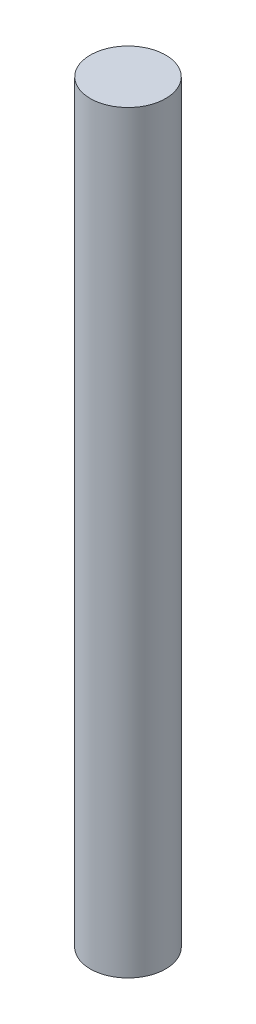
ISO-10303-21;
HEADER;
FILE_DESCRIPTION(('STEP AP214'),'2;1');
FILE_NAME('part.step','',(''),(''),'','','');
FILE_SCHEMA(('AUTOMOTIVE_DESIGN { 1 0 10303 214 1 1 1 1 }'));
ENDSEC;
DATA;
#1=APPLICATION_CONTEXT('core data for automotive mechanical design processes');
#2=APPLICATION_PROTOCOL_DEFINITION('international standard','automotive_design',2000,#1);
#3=PRODUCT_CONTEXT('',#1,'mechanical');
#4=PRODUCT('Part','Part','',(#3));
#5=PRODUCT_RELATED_PRODUCT_CATEGORY('part','',(#4));
#6=PRODUCT_DEFINITION_FORMATION('','',#4);
#7=PRODUCT_DEFINITION_CONTEXT('part definition',#1,'design');
#8=PRODUCT_DEFINITION('design','',#6,#7);
#9=PRODUCT_DEFINITION_SHAPE('','',#8);
#10=(LENGTH_UNIT() NAMED_UNIT(*) SI_UNIT(.MILLI.,.METRE.));
#11=(NAMED_UNIT(*) PLANE_ANGLE_UNIT() SI_UNIT($,.RADIAN.));
#12=(NAMED_UNIT(*) SI_UNIT($,.STERADIAN.) SOLID_ANGLE_UNIT());
#13=UNCERTAINTY_MEASURE_WITH_UNIT(LENGTH_MEASURE(1.E-05),#10,'distance_accuracy_value','');
#14=(GEOMETRIC_REPRESENTATION_CONTEXT(3) GLOBAL_UNCERTAINTY_ASSIGNED_CONTEXT((#13)) GLOBAL_UNIT_ASSIGNED_CONTEXT((#10,
#11,#12)) REPRESENTATION_CONTEXT('',''));
#15=CARTESIAN_POINT('',(0.,0.,0.));
#16=DIRECTION('',(0.,0.,1.));
#17=DIRECTION('',(1.,0.,0.));
#18=AXIS2_PLACEMENT_3D('',#15,#16,#17);
#19=CARTESIAN_POINT('',(0.,200.,0.));
#20=DIRECTION('',(0.,-1.,0.));
#21=DIRECTION('',(0.,0.,-1.));
#22=AXIS2_PLACEMENT_3D('',#19,#20,#21);
#23=CYLINDRICAL_SURFACE('',#22,10.);
#24=CARTESIAN_POINT('',(0.,200.,0.));
#25=DIRECTION('',(0.,1.,0.));
#26=DIRECTION('',(0.,0.,1.));
#27=AXIS2_PLACEMENT_3D('',#24,#25,#26);
#28=CIRCLE('',#27,10.);
#29=CARTESIAN_POINT('',(0.,200.,10.));
#30=VERTEX_POINT('',#29);
#31=EDGE_CURVE('E10',#30,#30,#28,.T.);
#32=ORIENTED_EDGE('',*,*,#31,.F.);
#33=EDGE_LOOP('',(#32));
#34=FACE_BOUND('',#33,.T.);
#35=CARTESIAN_POINT('',(0.,0.,0.));
#36=DIRECTION('',(0.,1.,0.));
#37=DIRECTION('',(0.,0.,1.));
#38=AXIS2_PLACEMENT_3D('',#35,#36,#37);
#39=CIRCLE('',#38,10.);
#40=CARTESIAN_POINT('',(0.,0.,10.));
#41=VERTEX_POINT('',#40);
#42=EDGE_CURVE('E39',#41,#41,#39,.T.);
#43=ORIENTED_EDGE('',*,*,#42,.T.);
#44=EDGE_LOOP('',(#43));
#45=FACE_BOUND('',#44,.T.);
#46=ADVANCED_FACE('F36',(#34,#45),#23,.T.);
#47=CARTESIAN_POINT('',(0.,200.,0.));
#48=DIRECTION('',(0.,1.,0.));
#49=DIRECTION('',(0.,0.,1.));
#50=AXIS2_PLACEMENT_3D('',#47,#48,#49);
#51=PLANE('',#50);
#52=ORIENTED_EDGE('',*,*,#31,.T.);
#53=EDGE_LOOP('',(#52));
#54=FACE_BOUND('',#53,.T.);
#55=ADVANCED_FACE('F51',(#54),#51,.T.);
#56=CARTESIAN_POINT('',(0.,0.,0.));
#57=DIRECTION('',(0.,1.,0.));
#58=DIRECTION('',(0.,0.,1.));
#59=AXIS2_PLACEMENT_3D('',#56,#57,#58);
#60=PLANE('',#59);
#61=ORIENTED_EDGE('',*,*,#42,.F.);
#62=EDGE_LOOP('',(#61));
#63=FACE_BOUND('',#62,.T.);
#64=ADVANCED_FACE('F49',(#63),#60,.F.);
#65=CLOSED_SHELL('',(#46,#55,#64));
#66=MANIFOLD_SOLID_BREP('B2',#65);
#67=ADVANCED_BREP_SHAPE_REPRESENTATION('',(#18,#66),#14);
#68=SHAPE_DEFINITION_REPRESENTATION(#9,#67);
ENDSEC;
END-ISO-10303-21;
